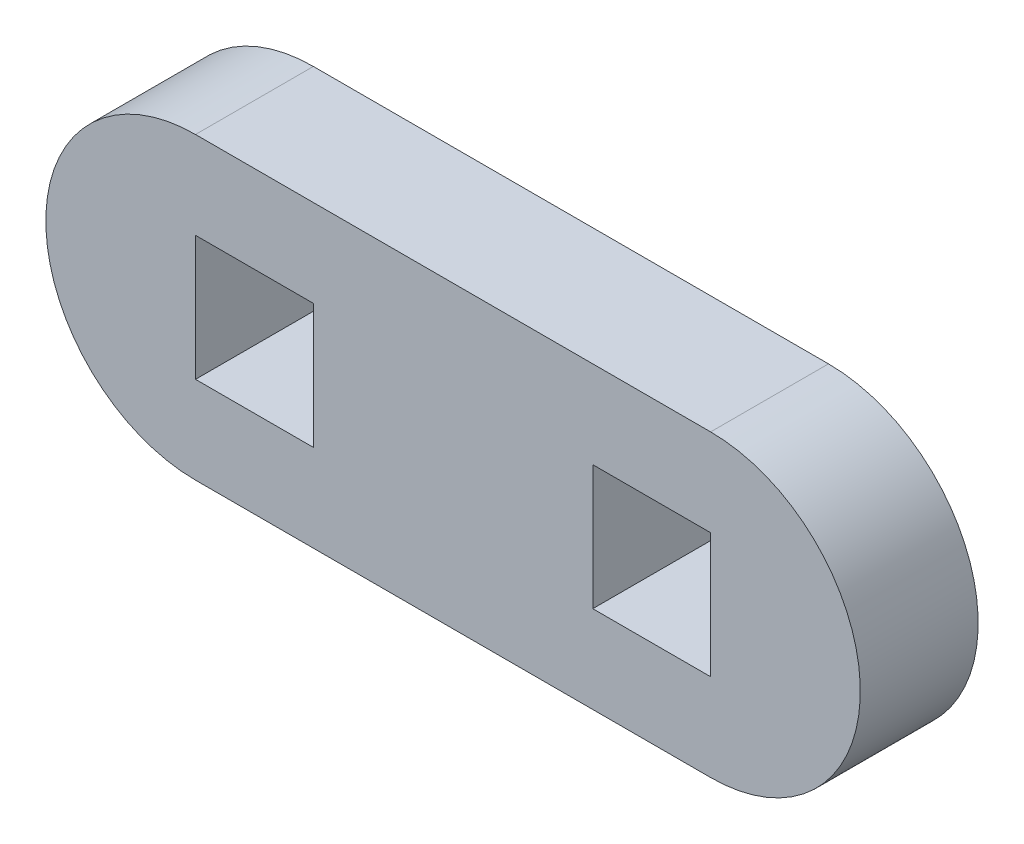
ISO-10303-21;
HEADER;
FILE_DESCRIPTION(('STEP AP214'),'2;1');
FILE_NAME('part.step','',(''),(''),'','','');
FILE_SCHEMA(('AUTOMOTIVE_DESIGN { 1 0 10303 214 1 1 1 1 }'));
ENDSEC;
DATA;
#1=APPLICATION_CONTEXT('core data for automotive mechanical design processes');
#2=APPLICATION_PROTOCOL_DEFINITION('international standard','automotive_design',2000,#1);
#3=PRODUCT_CONTEXT('',#1,'mechanical');
#4=PRODUCT('Part','Part','',(#3));
#5=PRODUCT_RELATED_PRODUCT_CATEGORY('part','',(#4));
#6=PRODUCT_DEFINITION_FORMATION('','',#4);
#7=PRODUCT_DEFINITION_CONTEXT('part definition',#1,'design');
#8=PRODUCT_DEFINITION('design','',#6,#7);
#9=PRODUCT_DEFINITION_SHAPE('','',#8);
#10=(LENGTH_UNIT() NAMED_UNIT(*) SI_UNIT(.MILLI.,.METRE.));
#11=(NAMED_UNIT(*) PLANE_ANGLE_UNIT() SI_UNIT($,.RADIAN.));
#12=(NAMED_UNIT(*) SI_UNIT($,.STERADIAN.) SOLID_ANGLE_UNIT());
#13=UNCERTAINTY_MEASURE_WITH_UNIT(LENGTH_MEASURE(1.E-05),#10,'distance_accuracy_value','');
#14=(GEOMETRIC_REPRESENTATION_CONTEXT(3) GLOBAL_UNCERTAINTY_ASSIGNED_CONTEXT((#13)) GLOBAL_UNIT_ASSIGNED_CONTEXT((#10,
#11,#12)) REPRESENTATION_CONTEXT('',''));
#15=CARTESIAN_POINT('',(0.,0.,0.));
#16=DIRECTION('',(0.,0.,1.));
#17=DIRECTION('',(1.,0.,0.));
#18=AXIS2_PLACEMENT_3D('',#15,#16,#17);
#19=CARTESIAN_POINT('',(297.889925988577,54.3694000003038,6.));
#20=DIRECTION('',(0.,0.,1.));
#21=DIRECTION('',(1.,0.,0.));
#22=AXIS2_PLACEMENT_3D('',#19,#20,#21);
#23=PLANE('',#22);
#24=CARTESIAN_POINT('',(297.889925988577,54.3694000003038,6.));
#25=DIRECTION('',(0.,0.,1.));
#26=DIRECTION('',(1.,0.,0.));
#27=AXIS2_PLACEMENT_3D('',#24,#25,#26);
#28=CIRCLE('',#27,7.62);
#29=CARTESIAN_POINT('',(297.889925988577,61.9894000003038,6.));
#30=VERTEX_POINT('',#29);
#31=CARTESIAN_POINT('',(297.889925988577,46.7494000003038,6.));
#32=VERTEX_POINT('',#31);
#33=EDGE_CURVE('E189',#30,#32,#28,.T.);
#34=ORIENTED_EDGE('',*,*,#33,.T.);
#35=DIRECTION('',(1.,0.,0.));
#36=VECTOR('',#35,1.);
#37=CARTESIAN_POINT('',(297.889925988577,46.7494000003038,6.));
#38=LINE('',#37,#36);
#39=CARTESIAN_POINT('',(324.113925988577,46.7494000003038,6.));
#40=VERTEX_POINT('',#39);
#41=EDGE_CURVE('E192',#32,#40,#38,.T.);
#42=ORIENTED_EDGE('',*,*,#41,.T.);
#43=CARTESIAN_POINT('',(324.113925988577,54.3694000003038,6.));
#44=DIRECTION('',(0.,0.,1.));
#45=DIRECTION('',(1.,0.,0.));
#46=AXIS2_PLACEMENT_3D('',#43,#44,#45);
#47=CIRCLE('',#46,7.62);
#48=CARTESIAN_POINT('',(324.113925988577,61.9894000003038,6.));
#49=VERTEX_POINT('',#48);
#50=EDGE_CURVE('E195',#40,#49,#47,.T.);
#51=ORIENTED_EDGE('',*,*,#50,.T.);
#52=DIRECTION('',(-1.,0.,0.));
#53=VECTOR('',#52,1.);
#54=CARTESIAN_POINT('',(297.889925988577,61.9894000003038,6.));
#55=LINE('',#54,#53);
#56=EDGE_CURVE('E197',#49,#30,#55,.T.);
#57=ORIENTED_EDGE('',*,*,#56,.T.);
#58=EDGE_LOOP('',(#34,#42,#51,#57));
#59=FACE_BOUND('',#58,.T.);
#60=DIRECTION('',(1.,0.,0.));
#61=VECTOR('',#60,1.);
#62=CARTESIAN_POINT('',(297.889925988577,51.1944000003039,6.));
#63=LINE('',#62,#61);
#64=CARTESIAN_POINT('',(297.889925988577,51.1944000003039,6.));
#65=VERTEX_POINT('',#64);
#66=CARTESIAN_POINT('',(303.889925988577,51.1944000003037,6.));
#67=VERTEX_POINT('',#66);
#68=EDGE_CURVE('E160',#65,#67,#63,.T.);
#69=ORIENTED_EDGE('',*,*,#68,.F.);
#70=DIRECTION('',(0.,-1.,0.));
#71=VECTOR('',#70,1.);
#72=CARTESIAN_POINT('',(297.889925988577,57.5444000003037,6.));
#73=LINE('',#72,#71);
#74=CARTESIAN_POINT('',(297.889925988577,57.5444000003037,6.));
#75=VERTEX_POINT('',#74);
#76=EDGE_CURVE('E158',#75,#65,#73,.T.);
#77=ORIENTED_EDGE('',*,*,#76,.F.);
#78=DIRECTION('',(-1.,0.,0.));
#79=VECTOR('',#78,1.);
#80=CARTESIAN_POINT('',(297.889925988577,57.5444000003037,6.));
#81=LINE('',#80,#79);
#82=CARTESIAN_POINT('',(303.889925988577,57.5444000003039,6.));
#83=VERTEX_POINT('',#82);
#84=EDGE_CURVE('E166',#83,#75,#81,.T.);
#85=ORIENTED_EDGE('',*,*,#84,.F.);
#86=DIRECTION('',(0.,1.,0.));
#87=VECTOR('',#86,1.);
#88=CARTESIAN_POINT('',(303.889925988577,57.5444000003039,6.));
#89=LINE('',#88,#87);
#90=EDGE_CURVE('E163',#67,#83,#89,.T.);
#91=ORIENTED_EDGE('',*,*,#90,.F.);
#92=EDGE_LOOP('',(#69,#77,#85,#91));
#93=FACE_BOUND('',#92,.T.);
#94=DIRECTION('',(1.,0.,0.));
#95=VECTOR('',#94,1.);
#96=CARTESIAN_POINT('',(318.113925988577,51.1944000003037,6.));
#97=LINE('',#96,#95);
#98=CARTESIAN_POINT('',(318.113925988577,51.1944000003037,6.));
#99=VERTEX_POINT('',#98);
#100=CARTESIAN_POINT('',(324.113925988577,51.1944000003039,6.));
#101=VERTEX_POINT('',#100);
#102=EDGE_CURVE('E130',#99,#101,#97,.T.);
#103=ORIENTED_EDGE('',*,*,#102,.F.);
#104=DIRECTION('',(0.,-1.,0.));
#105=VECTOR('',#104,1.);
#106=CARTESIAN_POINT('',(318.113925988577,57.5444000003039,6.));
#107=LINE('',#106,#105);
#108=CARTESIAN_POINT('',(318.113925988577,57.5444000003039,6.));
#109=VERTEX_POINT('',#108);
#110=EDGE_CURVE('E122',#109,#99,#107,.T.);
#111=ORIENTED_EDGE('',*,*,#110,.F.);
#112=DIRECTION('',(-1.,0.,0.));
#113=VECTOR('',#112,1.);
#114=CARTESIAN_POINT('',(318.113925988577,57.5444000003039,6.));
#115=LINE('',#114,#113);
#116=CARTESIAN_POINT('',(324.113925988576,57.5444000003038,6.));
#117=VERTEX_POINT('',#116);
#118=EDGE_CURVE('E144',#117,#109,#115,.T.);
#119=ORIENTED_EDGE('',*,*,#118,.F.);
#120=DIRECTION('',(0.,1.,0.));
#121=VECTOR('',#120,1.);
#122=CARTESIAN_POINT('',(324.113925988577,57.5444000003038,6.));
#123=LINE('',#122,#121);
#124=EDGE_CURVE('E142',#101,#117,#123,.T.);
#125=ORIENTED_EDGE('',*,*,#124,.F.);
#126=EDGE_LOOP('',(#103,#111,#119,#125));
#127=FACE_BOUND('',#126,.T.);
#128=ADVANCED_FACE('F33',(#59,#93,#127),#23,.T.);
#129=CARTESIAN_POINT('',(297.889925988577,54.3694000003038,0.));
#130=DIRECTION('',(0.,0.,1.));
#131=DIRECTION('',(1.,0.,0.));
#132=AXIS2_PLACEMENT_3D('',#129,#130,#131);
#133=PLANE('',#132);
#134=DIRECTION('',(0.,-1.,0.));
#135=VECTOR('',#134,1.);
#136=CARTESIAN_POINT('',(297.889925988577,57.5444000003037,0.));
#137=LINE('',#136,#135);
#138=CARTESIAN_POINT('',(297.889925988577,57.5444000003037,0.));
#139=VERTEX_POINT('',#138);
#140=CARTESIAN_POINT('',(297.889925988577,51.1944000003039,0.));
#141=VERTEX_POINT('',#140);
#142=EDGE_CURVE('E138',#139,#141,#137,.T.);
#143=ORIENTED_EDGE('',*,*,#142,.T.);
#144=DIRECTION('',(1.,0.,0.));
#145=VECTOR('',#144,1.);
#146=CARTESIAN_POINT('',(297.889925988577,51.1944000003039,0.));
#147=LINE('',#146,#145);
#148=CARTESIAN_POINT('',(303.889925988577,51.1944000003037,0.));
#149=VERTEX_POINT('',#148);
#150=EDGE_CURVE('E171',#141,#149,#147,.T.);
#151=ORIENTED_EDGE('',*,*,#150,.T.);
#152=DIRECTION('',(0.,1.,0.));
#153=VECTOR('',#152,1.);
#154=CARTESIAN_POINT('',(303.889925988577,57.5444000003039,0.));
#155=LINE('',#154,#153);
#156=CARTESIAN_POINT('',(303.889925988577,57.5444000003039,0.));
#157=VERTEX_POINT('',#156);
#158=EDGE_CURVE('E174',#149,#157,#155,.T.);
#159=ORIENTED_EDGE('',*,*,#158,.T.);
#160=DIRECTION('',(-1.,0.,0.));
#161=VECTOR('',#160,1.);
#162=CARTESIAN_POINT('',(297.889925988577,57.5444000003037,0.));
#163=LINE('',#162,#161);
#164=EDGE_CURVE('E161',#157,#139,#163,.T.);
#165=ORIENTED_EDGE('',*,*,#164,.T.);
#166=EDGE_LOOP('',(#143,#151,#159,#165));
#167=FACE_BOUND('',#166,.T.);
#168=CARTESIAN_POINT('',(297.889925988577,54.3694000003038,0.));
#169=DIRECTION('',(0.,0.,1.));
#170=DIRECTION('',(1.,0.,0.));
#171=AXIS2_PLACEMENT_3D('',#168,#169,#170);
#172=CIRCLE('',#171,7.62);
#173=CARTESIAN_POINT('',(297.889925988577,61.9894000003038,0.));
#174=VERTEX_POINT('',#173);
#175=CARTESIAN_POINT('',(297.889925988577,46.7494000003038,0.));
#176=VERTEX_POINT('',#175);
#177=EDGE_CURVE('E188',#174,#176,#172,.T.);
#178=ORIENTED_EDGE('',*,*,#177,.F.);
#179=DIRECTION('',(-1.,0.,0.));
#180=VECTOR('',#179,1.);
#181=CARTESIAN_POINT('',(297.889925988577,61.9894000003038,0.));
#182=LINE('',#181,#180);
#183=CARTESIAN_POINT('',(324.113925988577,61.9894000003038,0.));
#184=VERTEX_POINT('',#183);
#185=EDGE_CURVE('E193',#184,#174,#182,.T.);
#186=ORIENTED_EDGE('',*,*,#185,.F.);
#187=CARTESIAN_POINT('',(324.113925988577,54.3694000003038,0.));
#188=DIRECTION('',(0.,0.,1.));
#189=DIRECTION('',(1.,0.,0.));
#190=AXIS2_PLACEMENT_3D('',#187,#188,#189);
#191=CIRCLE('',#190,7.62);
#192=CARTESIAN_POINT('',(324.113925988577,46.7494000003038,0.));
#193=VERTEX_POINT('',#192);
#194=EDGE_CURVE('E204',#193,#184,#191,.T.);
#195=ORIENTED_EDGE('',*,*,#194,.F.);
#196=DIRECTION('',(1.,0.,0.));
#197=VECTOR('',#196,1.);
#198=CARTESIAN_POINT('',(297.889925988577,46.7494000003038,0.));
#199=LINE('',#198,#197);
#200=EDGE_CURVE('E202',#176,#193,#199,.T.);
#201=ORIENTED_EDGE('',*,*,#200,.F.);
#202=EDGE_LOOP('',(#178,#186,#195,#201));
#203=FACE_BOUND('',#202,.T.);
#204=DIRECTION('',(0.,-1.,0.));
#205=VECTOR('',#204,1.);
#206=CARTESIAN_POINT('',(318.113925988577,57.5444000003039,0.));
#207=LINE('',#206,#205);
#208=CARTESIAN_POINT('',(318.113925988577,57.5444000003039,0.));
#209=VERTEX_POINT('',#208);
#210=CARTESIAN_POINT('',(318.113925988577,51.1944000003037,0.));
#211=VERTEX_POINT('',#210);
#212=EDGE_CURVE('E56',#209,#211,#207,.T.);
#213=ORIENTED_EDGE('',*,*,#212,.T.);
#214=DIRECTION('',(1.,0.,0.));
#215=VECTOR('',#214,1.);
#216=CARTESIAN_POINT('',(318.113925988577,51.1944000003037,0.));
#217=LINE('',#216,#215);
#218=CARTESIAN_POINT('',(324.113925988577,51.1944000003039,0.));
#219=VERTEX_POINT('',#218);
#220=EDGE_CURVE('E137',#211,#219,#217,.T.);
#221=ORIENTED_EDGE('',*,*,#220,.T.);
#222=DIRECTION('',(0.,1.,0.));
#223=VECTOR('',#222,1.);
#224=CARTESIAN_POINT('',(324.113925988577,57.5444000003038,0.));
#225=LINE('',#224,#223);
#226=CARTESIAN_POINT('',(324.113925988577,57.5444000003038,0.));
#227=VERTEX_POINT('',#226);
#228=EDGE_CURVE('E150',#219,#227,#225,.T.);
#229=ORIENTED_EDGE('',*,*,#228,.T.);
#230=DIRECTION('',(-1.,0.,0.));
#231=VECTOR('',#230,1.);
#232=CARTESIAN_POINT('',(318.113925988577,57.5444000003039,0.));
#233=LINE('',#232,#231);
#234=EDGE_CURVE('E131',#227,#209,#233,.T.);
#235=ORIENTED_EDGE('',*,*,#234,.T.);
#236=EDGE_LOOP('',(#213,#221,#229,#235));
#237=FACE_BOUND('',#236,.T.);
#238=ADVANCED_FACE('F222',(#167,#203,#237),#133,.F.);
#239=CARTESIAN_POINT('',(297.889925988577,54.3694000003038,6.));
#240=DIRECTION('',(0.,0.,-1.));
#241=DIRECTION('',(-1.,0.,0.));
#242=AXIS2_PLACEMENT_3D('',#239,#240,#241);
#243=CYLINDRICAL_SURFACE('',#242,7.62);
#244=ORIENTED_EDGE('',*,*,#177,.T.);
#245=DIRECTION('',(0.,0.,-1.));
#246=VECTOR('',#245,1.);
#247=CARTESIAN_POINT('',(297.889925988577,46.7494000003038,6.));
#248=LINE('',#247,#246);
#249=EDGE_CURVE('E11',#32,#176,#248,.T.);
#250=ORIENTED_EDGE('',*,*,#249,.F.);
#251=ORIENTED_EDGE('',*,*,#33,.F.);
#252=DIRECTION('',(0.,0.,-1.));
#253=VECTOR('',#252,1.);
#254=CARTESIAN_POINT('',(297.889925988577,61.9894000003038,6.));
#255=LINE('',#254,#253);
#256=EDGE_CURVE('E199',#30,#174,#255,.T.);
#257=ORIENTED_EDGE('',*,*,#256,.T.);
#258=EDGE_LOOP('',(#244,#250,#251,#257));
#259=FACE_BOUND('',#258,.T.);
#260=ADVANCED_FACE('F35',(#259),#243,.T.);
#261=CARTESIAN_POINT('',(297.889925988577,46.7494000003038,6.));
#262=DIRECTION('',(0.,1.,0.));
#263=DIRECTION('',(0.,0.,1.));
#264=AXIS2_PLACEMENT_3D('',#261,#262,#263);
#265=PLANE('',#264);
#266=ORIENTED_EDGE('',*,*,#200,.T.);
#267=DIRECTION('',(0.,0.,-1.));
#268=VECTOR('',#267,1.);
#269=CARTESIAN_POINT('',(324.113925988577,46.7494000003038,6.));
#270=LINE('',#269,#268);
#271=EDGE_CURVE('E41',#40,#193,#270,.T.);
#272=ORIENTED_EDGE('',*,*,#271,.F.);
#273=ORIENTED_EDGE('',*,*,#41,.F.);
#274=ORIENTED_EDGE('',*,*,#249,.T.);
#275=EDGE_LOOP('',(#266,#272,#273,#274));
#276=FACE_BOUND('',#275,.T.);
#277=ADVANCED_FACE('F233',(#276),#265,.F.);
#278=CARTESIAN_POINT('',(324.113925988577,54.3694000003038,6.));
#279=DIRECTION('',(0.,0.,-1.));
#280=DIRECTION('',(-1.,0.,0.));
#281=AXIS2_PLACEMENT_3D('',#278,#279,#280);
#282=CYLINDRICAL_SURFACE('',#281,7.62);
#283=ORIENTED_EDGE('',*,*,#194,.T.);
#284=DIRECTION('',(0.,0.,-1.));
#285=VECTOR('',#284,1.);
#286=CARTESIAN_POINT('',(324.113925988577,61.9894000003038,6.));
#287=LINE('',#286,#285);
#288=EDGE_CURVE('E209',#49,#184,#287,.T.);
#289=ORIENTED_EDGE('',*,*,#288,.F.);
#290=ORIENTED_EDGE('',*,*,#50,.F.);
#291=ORIENTED_EDGE('',*,*,#271,.T.);
#292=EDGE_LOOP('',(#283,#289,#290,#291));
#293=FACE_BOUND('',#292,.T.);
#294=ADVANCED_FACE('F216',(#293),#282,.T.);
#295=CARTESIAN_POINT('',(297.889925988577,61.9894000003038,6.));
#296=DIRECTION('',(0.,-1.,0.));
#297=DIRECTION('',(0.,0.,-1.));
#298=AXIS2_PLACEMENT_3D('',#295,#296,#297);
#299=PLANE('',#298);
#300=ORIENTED_EDGE('',*,*,#185,.T.);
#301=ORIENTED_EDGE('',*,*,#256,.F.);
#302=ORIENTED_EDGE('',*,*,#56,.F.);
#303=ORIENTED_EDGE('',*,*,#288,.T.);
#304=EDGE_LOOP('',(#300,#301,#302,#303));
#305=FACE_BOUND('',#304,.T.);
#306=ADVANCED_FACE('F226',(#305),#299,.F.);
#307=CARTESIAN_POINT('',(297.889925988577,57.5444000003037,6.));
#308=DIRECTION('',(1.,0.,0.));
#309=DIRECTION('',(0.,0.,-1.));
#310=AXIS2_PLACEMENT_3D('',#307,#308,#309);
#311=PLANE('',#310);
#312=ORIENTED_EDGE('',*,*,#142,.F.);
#313=DIRECTION('',(0.,0.,-1.));
#314=VECTOR('',#313,1.);
#315=CARTESIAN_POINT('',(297.889925988577,57.5444000003037,6.));
#316=LINE('',#315,#314);
#317=EDGE_CURVE('E168',#75,#139,#316,.T.);
#318=ORIENTED_EDGE('',*,*,#317,.F.);
#319=ORIENTED_EDGE('',*,*,#76,.T.);
#320=DIRECTION('',(0.,0.,-1.));
#321=VECTOR('',#320,1.);
#322=CARTESIAN_POINT('',(297.889925988577,51.1944000003039,6.));
#323=LINE('',#322,#321);
#324=EDGE_CURVE('E185',#65,#141,#323,.T.);
#325=ORIENTED_EDGE('',*,*,#324,.T.);
#326=EDGE_LOOP('',(#312,#318,#319,#325));
#327=FACE_BOUND('',#326,.T.);
#328=ADVANCED_FACE('F248',(#327),#311,.T.);
#329=CARTESIAN_POINT('',(297.889925988577,51.1944000003039,6.));
#330=DIRECTION('',(0.,1.,0.));
#331=DIRECTION('',(-1.,0.,0.));
#332=AXIS2_PLACEMENT_3D('',#329,#330,#331);
#333=PLANE('',#332);
#334=ORIENTED_EDGE('',*,*,#150,.F.);
#335=ORIENTED_EDGE('',*,*,#324,.F.);
#336=ORIENTED_EDGE('',*,*,#68,.T.);
#337=DIRECTION('',(0.,0.,-1.));
#338=VECTOR('',#337,1.);
#339=CARTESIAN_POINT('',(303.889925988577,51.1944000003037,6.));
#340=LINE('',#339,#338);
#341=EDGE_CURVE('E183',#67,#149,#340,.T.);
#342=ORIENTED_EDGE('',*,*,#341,.T.);
#343=EDGE_LOOP('',(#334,#335,#336,#342));
#344=FACE_BOUND('',#343,.T.);
#345=ADVANCED_FACE('F255',(#344),#333,.T.);
#346=CARTESIAN_POINT('',(303.889925988577,57.5444000003039,6.));
#347=DIRECTION('',(-1.,0.,0.));
#348=DIRECTION('',(0.,0.,1.));
#349=AXIS2_PLACEMENT_3D('',#346,#347,#348);
#350=PLANE('',#349);
#351=ORIENTED_EDGE('',*,*,#158,.F.);
#352=ORIENTED_EDGE('',*,*,#341,.F.);
#353=ORIENTED_EDGE('',*,*,#90,.T.);
#354=DIRECTION('',(0.,0.,-1.));
#355=VECTOR('',#354,1.);
#356=CARTESIAN_POINT('',(303.889925988577,57.5444000003039,6.));
#357=LINE('',#356,#355);
#358=EDGE_CURVE('E181',#83,#157,#357,.T.);
#359=ORIENTED_EDGE('',*,*,#358,.T.);
#360=EDGE_LOOP('',(#351,#352,#353,#359));
#361=FACE_BOUND('',#360,.T.);
#362=ADVANCED_FACE('F260',(#361),#350,.T.);
#363=CARTESIAN_POINT('',(297.889925988577,57.5444000003037,6.));
#364=DIRECTION('',(0.,-1.,0.));
#365=DIRECTION('',(1.,0.,0.));
#366=AXIS2_PLACEMENT_3D('',#363,#364,#365);
#367=PLANE('',#366);
#368=ORIENTED_EDGE('',*,*,#164,.F.);
#369=ORIENTED_EDGE('',*,*,#358,.F.);
#370=ORIENTED_EDGE('',*,*,#84,.T.);
#371=ORIENTED_EDGE('',*,*,#317,.T.);
#372=EDGE_LOOP('',(#368,#369,#370,#371));
#373=FACE_BOUND('',#372,.T.);
#374=ADVANCED_FACE('F267',(#373),#367,.T.);
#375=CARTESIAN_POINT('',(318.113925988577,57.5444000003039,6.));
#376=DIRECTION('',(1.,0.,0.));
#377=DIRECTION('',(0.,0.,-1.));
#378=AXIS2_PLACEMENT_3D('',#375,#376,#377);
#379=PLANE('',#378);
#380=ORIENTED_EDGE('',*,*,#212,.F.);
#381=DIRECTION('',(0.,0.,-1.));
#382=VECTOR('',#381,1.);
#383=CARTESIAN_POINT('',(318.113925988577,57.5444000003039,6.));
#384=LINE('',#383,#382);
#385=EDGE_CURVE('E126',#109,#209,#384,.T.);
#386=ORIENTED_EDGE('',*,*,#385,.F.);
#387=ORIENTED_EDGE('',*,*,#110,.T.);
#388=DIRECTION('',(0.,0.,-1.));
#389=VECTOR('',#388,1.);
#390=CARTESIAN_POINT('',(318.113925988577,51.1944000003037,6.));
#391=LINE('',#390,#389);
#392=EDGE_CURVE('E125',#99,#211,#391,.T.);
#393=ORIENTED_EDGE('',*,*,#392,.T.);
#394=EDGE_LOOP('',(#380,#386,#387,#393));
#395=FACE_BOUND('',#394,.T.);
#396=ADVANCED_FACE('F124',(#395),#379,.T.);
#397=CARTESIAN_POINT('',(318.113925988577,51.1944000003037,6.));
#398=DIRECTION('',(0.,1.,0.));
#399=DIRECTION('',(-1.,0.,0.));
#400=AXIS2_PLACEMENT_3D('',#397,#398,#399);
#401=PLANE('',#400);
#402=ORIENTED_EDGE('',*,*,#220,.F.);
#403=ORIENTED_EDGE('',*,*,#392,.F.);
#404=ORIENTED_EDGE('',*,*,#102,.T.);
#405=DIRECTION('',(0.,0.,-1.));
#406=VECTOR('',#405,1.);
#407=CARTESIAN_POINT('',(324.113925988577,51.1944000003039,6.));
#408=LINE('',#407,#406);
#409=EDGE_CURVE('E139',#101,#219,#408,.T.);
#410=ORIENTED_EDGE('',*,*,#409,.T.);
#411=EDGE_LOOP('',(#402,#403,#404,#410));
#412=FACE_BOUND('',#411,.T.);
#413=ADVANCED_FACE('F134',(#412),#401,.T.);
#414=CARTESIAN_POINT('',(324.113925988577,57.5444000003038,6.));
#415=DIRECTION('',(-1.,0.,0.));
#416=DIRECTION('',(0.,0.,1.));
#417=AXIS2_PLACEMENT_3D('',#414,#415,#416);
#418=PLANE('',#417);
#419=ORIENTED_EDGE('',*,*,#228,.F.);
#420=ORIENTED_EDGE('',*,*,#409,.F.);
#421=ORIENTED_EDGE('',*,*,#124,.T.);
#422=DIRECTION('',(0.,0.,-1.));
#423=VECTOR('',#422,1.);
#424=CARTESIAN_POINT('',(324.113925988577,57.5444000003038,6.));
#425=LINE('',#424,#423);
#426=EDGE_CURVE('E48',#117,#227,#425,.T.);
#427=ORIENTED_EDGE('',*,*,#426,.T.);
#428=EDGE_LOOP('',(#419,#420,#421,#427));
#429=FACE_BOUND('',#428,.T.);
#430=ADVANCED_FACE('F285',(#429),#418,.T.);
#431=CARTESIAN_POINT('',(318.113925988577,57.5444000003039,6.));
#432=DIRECTION('',(0.,-1.,0.));
#433=DIRECTION('',(1.,0.,0.));
#434=AXIS2_PLACEMENT_3D('',#431,#432,#433);
#435=PLANE('',#434);
#436=ORIENTED_EDGE('',*,*,#234,.F.);
#437=ORIENTED_EDGE('',*,*,#426,.F.);
#438=ORIENTED_EDGE('',*,*,#118,.T.);
#439=ORIENTED_EDGE('',*,*,#385,.T.);
#440=EDGE_LOOP('',(#436,#437,#438,#439));
#441=FACE_BOUND('',#440,.T.);
#442=ADVANCED_FACE('F288',(#441),#435,.T.);
#443=CLOSED_SHELL('',(#128,#238,#260,#277,#294,#306,#328,#345,#362,#374,#396,#413,#430,#442));
#444=MANIFOLD_SOLID_BREP('B2',#443);
#445=ADVANCED_BREP_SHAPE_REPRESENTATION('',(#18,#444),#14);
#446=SHAPE_DEFINITION_REPRESENTATION(#9,#445);
ENDSEC;
END-ISO-10303-21;
